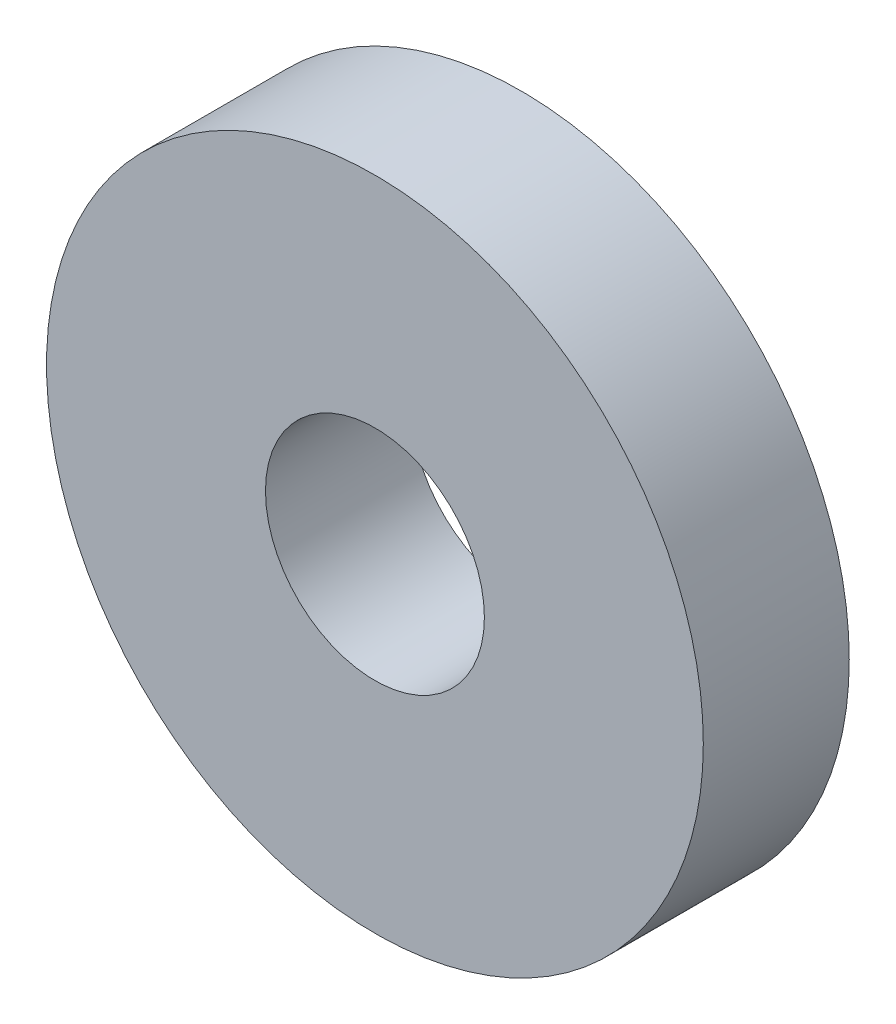
ISO-10303-21;
HEADER;
FILE_DESCRIPTION(('STEP AP214'),'2;1');
FILE_NAME('part.step','',(''),(''),'','','');
FILE_SCHEMA(('AUTOMOTIVE_DESIGN { 1 0 10303 214 1 1 1 1 }'));
ENDSEC;
DATA;
#1=APPLICATION_CONTEXT('core data for automotive mechanical design processes');
#2=APPLICATION_PROTOCOL_DEFINITION('international standard','automotive_design',2000,#1);
#3=PRODUCT_CONTEXT('',#1,'mechanical');
#4=PRODUCT('Part','Part','',(#3));
#5=PRODUCT_RELATED_PRODUCT_CATEGORY('part','',(#4));
#6=PRODUCT_DEFINITION_FORMATION('','',#4);
#7=PRODUCT_DEFINITION_CONTEXT('part definition',#1,'design');
#8=PRODUCT_DEFINITION('design','',#6,#7);
#9=PRODUCT_DEFINITION_SHAPE('','',#8);
#10=(LENGTH_UNIT() NAMED_UNIT(*) SI_UNIT(.MILLI.,.METRE.));
#11=(NAMED_UNIT(*) PLANE_ANGLE_UNIT() SI_UNIT($,.RADIAN.));
#12=(NAMED_UNIT(*) SI_UNIT($,.STERADIAN.) SOLID_ANGLE_UNIT());
#13=UNCERTAINTY_MEASURE_WITH_UNIT(LENGTH_MEASURE(1.E-05),#10,'distance_accuracy_value','');
#14=(GEOMETRIC_REPRESENTATION_CONTEXT(3) GLOBAL_UNCERTAINTY_ASSIGNED_CONTEXT((#13)) GLOBAL_UNIT_ASSIGNED_CONTEXT((#10,
#11,#12)) REPRESENTATION_CONTEXT('',''));
#15=CARTESIAN_POINT('',(0.,0.,0.));
#16=DIRECTION('',(0.,0.,1.));
#17=DIRECTION('',(1.,0.,0.));
#18=AXIS2_PLACEMENT_3D('',#15,#16,#17);
#19=CARTESIAN_POINT('',(0.,0.,2.));
#20=DIRECTION('',(0.,0.,1.));
#21=DIRECTION('',(1.,0.,0.));
#22=AXIS2_PLACEMENT_3D('',#19,#20,#21);
#23=PLANE('',#22);
#24=CARTESIAN_POINT('',(0.,0.,2.));
#25=DIRECTION('',(0.,0.,1.));
#26=DIRECTION('',(1.,0.,0.));
#27=AXIS2_PLACEMENT_3D('',#24,#25,#26);
#28=CIRCLE('',#27,4.5);
#29=CARTESIAN_POINT('',(4.5,0.,2.));
#30=VERTEX_POINT('',#29);
#31=EDGE_CURVE('E10',#30,#30,#28,.T.);
#32=ORIENTED_EDGE('',*,*,#31,.T.);
#33=EDGE_LOOP('',(#32));
#34=FACE_BOUND('',#33,.T.);
#35=CARTESIAN_POINT('',(0.,0.,2.));
#36=DIRECTION('',(0.,0.,1.));
#37=DIRECTION('',(1.,0.,0.));
#38=AXIS2_PLACEMENT_3D('',#35,#36,#37);
#39=CIRCLE('',#38,1.5);
#40=CARTESIAN_POINT('',(1.5,0.,2.));
#41=VERTEX_POINT('',#40);
#42=EDGE_CURVE('E50',#41,#41,#39,.T.);
#43=ORIENTED_EDGE('',*,*,#42,.F.);
#44=EDGE_LOOP('',(#43));
#45=FACE_BOUND('',#44,.T.);
#46=ADVANCED_FACE('F39',(#34,#45),#23,.T.);
#47=CARTESIAN_POINT('',(0.,0.,0.));
#48=DIRECTION('',(0.,0.,1.));
#49=DIRECTION('',(1.,0.,0.));
#50=AXIS2_PLACEMENT_3D('',#47,#48,#49);
#51=PLANE('',#50);
#52=CARTESIAN_POINT('',(0.,0.,0.));
#53=DIRECTION('',(0.,0.,1.));
#54=DIRECTION('',(1.,0.,0.));
#55=AXIS2_PLACEMENT_3D('',#52,#53,#54);
#56=CIRCLE('',#55,4.5);
#57=CARTESIAN_POINT('',(4.5,0.,0.));
#58=VERTEX_POINT('',#57);
#59=EDGE_CURVE('E43',#58,#58,#56,.T.);
#60=ORIENTED_EDGE('',*,*,#59,.F.);
#61=EDGE_LOOP('',(#60));
#62=FACE_BOUND('',#61,.T.);
#63=CARTESIAN_POINT('',(0.,0.,0.));
#64=DIRECTION('',(0.,0.,1.));
#65=DIRECTION('',(1.,0.,0.));
#66=AXIS2_PLACEMENT_3D('',#63,#64,#65);
#67=CIRCLE('',#66,1.5);
#68=CARTESIAN_POINT('',(1.5,0.,0.));
#69=VERTEX_POINT('',#68);
#70=EDGE_CURVE('E52',#69,#69,#67,.T.);
#71=ORIENTED_EDGE('',*,*,#70,.T.);
#72=EDGE_LOOP('',(#71));
#73=FACE_BOUND('',#72,.T.);
#74=ADVANCED_FACE('F62',(#62,#73),#51,.F.);
#75=CARTESIAN_POINT('',(0.,0.,2.));
#76=DIRECTION('',(0.,0.,-1.));
#77=DIRECTION('',(-1.,0.,0.));
#78=AXIS2_PLACEMENT_3D('',#75,#76,#77);
#79=CYLINDRICAL_SURFACE('',#78,4.5);
#80=ORIENTED_EDGE('',*,*,#31,.F.);
#81=EDGE_LOOP('',(#80));
#82=FACE_BOUND('',#81,.T.);
#83=ORIENTED_EDGE('',*,*,#59,.T.);
#84=EDGE_LOOP('',(#83));
#85=FACE_BOUND('',#84,.T.);
#86=ADVANCED_FACE('F41',(#82,#85),#79,.T.);
#87=CARTESIAN_POINT('',(0.,0.,2.));
#88=DIRECTION('',(0.,0.,-1.));
#89=DIRECTION('',(-1.,0.,0.));
#90=AXIS2_PLACEMENT_3D('',#87,#88,#89);
#91=CYLINDRICAL_SURFACE('',#90,1.5);
#92=ORIENTED_EDGE('',*,*,#42,.T.);
#93=EDGE_LOOP('',(#92));
#94=FACE_BOUND('',#93,.T.);
#95=ORIENTED_EDGE('',*,*,#70,.F.);
#96=EDGE_LOOP('',(#95));
#97=FACE_BOUND('',#96,.T.);
#98=ADVANCED_FACE('F58',(#94,#97),#91,.F.);
#99=CLOSED_SHELL('',(#46,#74,#86,#98));
#100=MANIFOLD_SOLID_BREP('B2',#99);
#101=ADVANCED_BREP_SHAPE_REPRESENTATION('',(#18,#100),#14);
#102=SHAPE_DEFINITION_REPRESENTATION(#9,#101);
ENDSEC;
END-ISO-10303-21;
